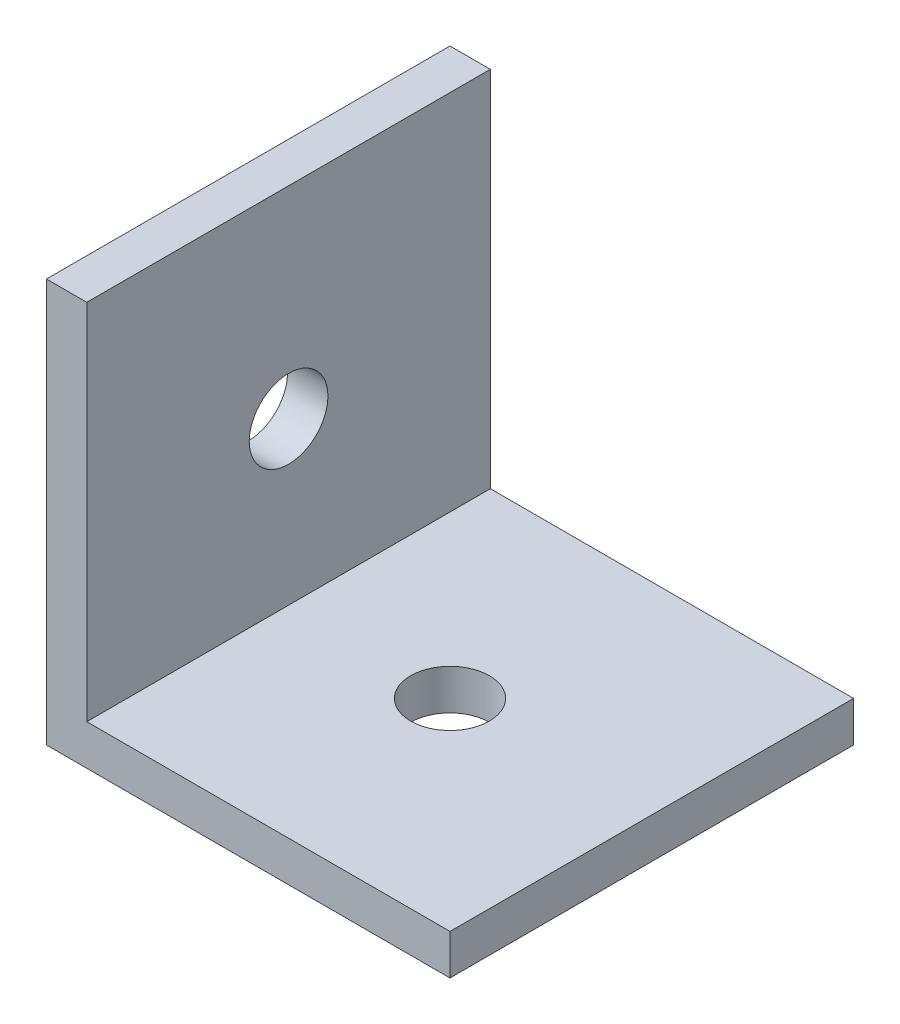
ISO-10303-21;
HEADER;
FILE_DESCRIPTION(('STEP AP214'),'2;1');
FILE_NAME('part.step','',(''),(''),'','','');
FILE_SCHEMA(('AUTOMOTIVE_DESIGN { 1 0 10303 214 1 1 1 1 }'));
ENDSEC;
DATA;
#1=APPLICATION_CONTEXT('core data for automotive mechanical design processes');
#2=APPLICATION_PROTOCOL_DEFINITION('international standard','automotive_design',2000,#1);
#3=PRODUCT_CONTEXT('',#1,'mechanical');
#4=PRODUCT('Part','Part','',(#3));
#5=PRODUCT_RELATED_PRODUCT_CATEGORY('part','',(#4));
#6=PRODUCT_DEFINITION_FORMATION('','',#4);
#7=PRODUCT_DEFINITION_CONTEXT('part definition',#1,'design');
#8=PRODUCT_DEFINITION('design','',#6,#7);
#9=PRODUCT_DEFINITION_SHAPE('','',#8);
#10=(LENGTH_UNIT() NAMED_UNIT(*) SI_UNIT(.MILLI.,.METRE.));
#11=(NAMED_UNIT(*) PLANE_ANGLE_UNIT() SI_UNIT($,.RADIAN.));
#12=(NAMED_UNIT(*) SI_UNIT($,.STERADIAN.) SOLID_ANGLE_UNIT());
#13=UNCERTAINTY_MEASURE_WITH_UNIT(LENGTH_MEASURE(1.E-05),#10,'distance_accuracy_value','');
#14=(GEOMETRIC_REPRESENTATION_CONTEXT(3) GLOBAL_UNCERTAINTY_ASSIGNED_CONTEXT((#13)) GLOBAL_UNIT_ASSIGNED_CONTEXT((#10,
#11,#12)) REPRESENTATION_CONTEXT('',''));
#15=CARTESIAN_POINT('',(0.,0.,0.));
#16=DIRECTION('',(0.,0.,1.));
#17=DIRECTION('',(1.,0.,0.));
#18=AXIS2_PLACEMENT_3D('',#15,#16,#17);
#19=CARTESIAN_POINT('',(0.,0.,25.4));
#20=DIRECTION('',(0.,1.,0.));
#21=DIRECTION('',(0.,0.,1.));
#22=AXIS2_PLACEMENT_3D('',#19,#20,#21);
#23=PLANE('',#22);
#24=CARTESIAN_POINT('',(12.7,0.,12.7));
#25=DIRECTION('',(0.,-1.,0.));
#26=DIRECTION('',(0.,0.,-1.));
#27=AXIS2_PLACEMENT_3D('',#24,#25,#26);
#28=CIRCLE('',#27,2.4765);
#29=CARTESIAN_POINT('',(12.7,0.,10.2235));
#30=VERTEX_POINT('',#29);
#31=EDGE_CURVE('E164',#30,#30,#28,.T.);
#32=ORIENTED_EDGE('',*,*,#31,.F.);
#33=EDGE_LOOP('',(#32));
#34=FACE_BOUND('',#33,.T.);
#35=DIRECTION('',(1.,0.,0.));
#36=VECTOR('',#35,1.);
#37=CARTESIAN_POINT('',(0.,0.,0.));
#38=LINE('',#37,#36);
#39=CARTESIAN_POINT('',(0.,0.,0.));
#40=VERTEX_POINT('',#39);
#41=CARTESIAN_POINT('',(25.4,0.,0.));
#42=VERTEX_POINT('',#41);
#43=EDGE_CURVE('E117',#40,#42,#38,.T.);
#44=ORIENTED_EDGE('',*,*,#43,.T.);
#45=DIRECTION('',(0.,0.,-1.));
#46=VECTOR('',#45,1.);
#47=CARTESIAN_POINT('',(25.4,0.,25.4));
#48=LINE('',#47,#46);
#49=CARTESIAN_POINT('',(25.4,0.,25.4));
#50=VERTEX_POINT('',#49);
#51=EDGE_CURVE('E11',#50,#42,#48,.T.);
#52=ORIENTED_EDGE('',*,*,#51,.F.);
#53=DIRECTION('',(1.,0.,0.));
#54=VECTOR('',#53,1.);
#55=CARTESIAN_POINT('',(0.,0.,25.4));
#56=LINE('',#55,#54);
#57=CARTESIAN_POINT('',(0.,0.,25.4));
#58=VERTEX_POINT('',#57);
#59=EDGE_CURVE('E82',#58,#50,#56,.T.);
#60=ORIENTED_EDGE('',*,*,#59,.F.);
#61=DIRECTION('',(0.,0.,-1.));
#62=VECTOR('',#61,1.);
#63=CARTESIAN_POINT('',(0.,0.,25.4));
#64=LINE('',#63,#62);
#65=EDGE_CURVE('E113',#58,#40,#64,.T.);
#66=ORIENTED_EDGE('',*,*,#65,.T.);
#67=EDGE_LOOP('',(#44,#52,#60,#66));
#68=FACE_BOUND('',#67,.T.);
#69=ADVANCED_FACE('F35',(#34,#68),#23,.F.);
#70=CARTESIAN_POINT('',(25.4,2.54,25.4));
#71=DIRECTION('',(1.,0.,0.));
#72=DIRECTION('',(0.,0.,-1.));
#73=AXIS2_PLACEMENT_3D('',#70,#71,#72);
#74=PLANE('',#73);
#75=DIRECTION('',(0.,-1.,0.));
#76=VECTOR('',#75,1.);
#77=CARTESIAN_POINT('',(25.4,2.54,0.));
#78=LINE('',#77,#76);
#79=CARTESIAN_POINT('',(25.4,2.54,0.));
#80=VERTEX_POINT('',#79);
#81=EDGE_CURVE('E120',#80,#42,#78,.T.);
#82=ORIENTED_EDGE('',*,*,#81,.F.);
#83=DIRECTION('',(0.,0.,-1.));
#84=VECTOR('',#83,1.);
#85=CARTESIAN_POINT('',(25.4,2.54,25.4));
#86=LINE('',#85,#84);
#87=CARTESIAN_POINT('',(25.4,2.54,25.4));
#88=VERTEX_POINT('',#87);
#89=EDGE_CURVE('E44',#88,#80,#86,.T.);
#90=ORIENTED_EDGE('',*,*,#89,.F.);
#91=DIRECTION('',(0.,-1.,0.));
#92=VECTOR('',#91,1.);
#93=CARTESIAN_POINT('',(25.4,2.54,25.4));
#94=LINE('',#93,#92);
#95=EDGE_CURVE('E175',#88,#50,#94,.T.);
#96=ORIENTED_EDGE('',*,*,#95,.T.);
#97=ORIENTED_EDGE('',*,*,#51,.T.);
#98=EDGE_LOOP('',(#82,#90,#96,#97));
#99=FACE_BOUND('',#98,.T.);
#100=ADVANCED_FACE('F140',(#99),#74,.T.);
#101=CARTESIAN_POINT('',(0.,2.54,25.4));
#102=DIRECTION('',(0.,1.,0.));
#103=DIRECTION('',(0.,0.,1.));
#104=AXIS2_PLACEMENT_3D('',#101,#102,#103);
#105=PLANE('',#104);
#106=CARTESIAN_POINT('',(12.7,2.54,12.7));
#107=DIRECTION('',(0.,1.,0.));
#108=DIRECTION('',(0.,0.,1.));
#109=AXIS2_PLACEMENT_3D('',#106,#107,#108);
#110=CIRCLE('',#109,2.4765);
#111=CARTESIAN_POINT('',(12.7,2.54,15.1765));
#112=VERTEX_POINT('',#111);
#113=EDGE_CURVE('E38',#112,#112,#110,.T.);
#114=ORIENTED_EDGE('',*,*,#113,.F.);
#115=EDGE_LOOP('',(#114));
#116=FACE_BOUND('',#115,.T.);
#117=DIRECTION('',(1.,0.,0.));
#118=VECTOR('',#117,1.);
#119=CARTESIAN_POINT('',(0.,2.54,0.));
#120=LINE('',#119,#118);
#121=CARTESIAN_POINT('',(2.54,2.54,0.));
#122=VERTEX_POINT('',#121);
#123=EDGE_CURVE('E124',#122,#80,#120,.T.);
#124=ORIENTED_EDGE('',*,*,#123,.F.);
#125=DIRECTION('',(0.,0.,-1.));
#126=VECTOR('',#125,1.);
#127=CARTESIAN_POINT('',(2.54,2.54,25.4));
#128=LINE('',#127,#126);
#129=CARTESIAN_POINT('',(2.54,2.54,25.4));
#130=VERTEX_POINT('',#129);
#131=EDGE_CURVE('E103',#130,#122,#128,.T.);
#132=ORIENTED_EDGE('',*,*,#131,.F.);
#133=DIRECTION('',(1.,0.,0.));
#134=VECTOR('',#133,1.);
#135=CARTESIAN_POINT('',(0.,2.54,25.4));
#136=LINE('',#135,#134);
#137=EDGE_CURVE('E109',#130,#88,#136,.T.);
#138=ORIENTED_EDGE('',*,*,#137,.T.);
#139=ORIENTED_EDGE('',*,*,#89,.T.);
#140=EDGE_LOOP('',(#124,#132,#138,#139));
#141=FACE_BOUND('',#140,.T.);
#142=ADVANCED_FACE('F137',(#116,#141),#105,.T.);
#143=CARTESIAN_POINT('',(2.54,0.,25.4));
#144=DIRECTION('',(1.,0.,0.));
#145=DIRECTION('',(0.,0.,-1.));
#146=AXIS2_PLACEMENT_3D('',#143,#144,#145);
#147=PLANE('',#146);
#148=CARTESIAN_POINT('',(2.54,12.7,12.7));
#149=DIRECTION('',(1.,0.,0.));
#150=DIRECTION('',(0.,0.,-1.));
#151=AXIS2_PLACEMENT_3D('',#148,#149,#150);
#152=CIRCLE('',#151,2.4765);
#153=CARTESIAN_POINT('',(2.54,12.7,10.2235));
#154=VERTEX_POINT('',#153);
#155=EDGE_CURVE('E121',#154,#154,#152,.T.);
#156=ORIENTED_EDGE('',*,*,#155,.F.);
#157=EDGE_LOOP('',(#156));
#158=FACE_BOUND('',#157,.T.);
#159=DIRECTION('',(0.,1.,0.));
#160=VECTOR('',#159,1.);
#161=CARTESIAN_POINT('',(2.54,0.,0.));
#162=LINE('',#161,#160);
#163=CARTESIAN_POINT('',(2.54,25.4,0.));
#164=VERTEX_POINT('',#163);
#165=EDGE_CURVE('E98',#164,#122,#162,.F.);
#166=ORIENTED_EDGE('',*,*,#165,.F.);
#167=DIRECTION('',(0.,0.,-1.));
#168=VECTOR('',#167,1.);
#169=CARTESIAN_POINT('',(2.54,25.4,25.4));
#170=LINE('',#169,#168);
#171=CARTESIAN_POINT('',(2.54,25.4,25.4));
#172=VERTEX_POINT('',#171);
#173=EDGE_CURVE('E93',#172,#164,#170,.T.);
#174=ORIENTED_EDGE('',*,*,#173,.F.);
#175=DIRECTION('',(0.,1.,0.));
#176=VECTOR('',#175,1.);
#177=CARTESIAN_POINT('',(2.54,0.,25.4));
#178=LINE('',#177,#176);
#179=EDGE_CURVE('E96',#172,#130,#178,.F.);
#180=ORIENTED_EDGE('',*,*,#179,.T.);
#181=ORIENTED_EDGE('',*,*,#131,.T.);
#182=EDGE_LOOP('',(#166,#174,#180,#181));
#183=FACE_BOUND('',#182,.T.);
#184=ADVANCED_FACE('F95',(#158,#183),#147,.T.);
#185=CARTESIAN_POINT('',(0.,25.4,25.4));
#186=DIRECTION('',(0.,1.,0.));
#187=DIRECTION('',(0.,0.,1.));
#188=AXIS2_PLACEMENT_3D('',#185,#186,#187);
#189=PLANE('',#188);
#190=DIRECTION('',(1.,0.,0.));
#191=VECTOR('',#190,1.);
#192=CARTESIAN_POINT('',(0.,25.4,0.));
#193=LINE('',#192,#191);
#194=CARTESIAN_POINT('',(0.,25.4,0.));
#195=VERTEX_POINT('',#194);
#196=EDGE_CURVE('E128',#195,#164,#193,.T.);
#197=ORIENTED_EDGE('',*,*,#196,.F.);
#198=DIRECTION('',(0.,0.,-1.));
#199=VECTOR('',#198,1.);
#200=CARTESIAN_POINT('',(0.,25.4,25.4));
#201=LINE('',#200,#199);
#202=CARTESIAN_POINT('',(0.,25.4,25.4));
#203=VERTEX_POINT('',#202);
#204=EDGE_CURVE('E73',#203,#195,#201,.T.);
#205=ORIENTED_EDGE('',*,*,#204,.F.);
#206=DIRECTION('',(1.,0.,0.));
#207=VECTOR('',#206,1.);
#208=CARTESIAN_POINT('',(0.,25.4,25.4));
#209=LINE('',#208,#207);
#210=EDGE_CURVE('E107',#203,#172,#209,.T.);
#211=ORIENTED_EDGE('',*,*,#210,.T.);
#212=ORIENTED_EDGE('',*,*,#173,.T.);
#213=EDGE_LOOP('',(#197,#205,#211,#212));
#214=FACE_BOUND('',#213,.T.);
#215=ADVANCED_FACE('F111',(#214),#189,.T.);
#216=CARTESIAN_POINT('',(0.,0.,25.4));
#217=DIRECTION('',(1.,0.,0.));
#218=DIRECTION('',(0.,0.,-1.));
#219=AXIS2_PLACEMENT_3D('',#216,#217,#218);
#220=PLANE('',#219);
#221=CARTESIAN_POINT('',(0.,12.7,12.7));
#222=DIRECTION('',(-1.,0.,0.));
#223=DIRECTION('',(0.,0.,1.));
#224=AXIS2_PLACEMENT_3D('',#221,#222,#223);
#225=CIRCLE('',#224,2.4765);
#226=CARTESIAN_POINT('',(0.,12.7,15.1765));
#227=VERTEX_POINT('',#226);
#228=EDGE_CURVE('E168',#227,#227,#225,.T.);
#229=ORIENTED_EDGE('',*,*,#228,.F.);
#230=EDGE_LOOP('',(#229));
#231=FACE_BOUND('',#230,.T.);
#232=DIRECTION('',(0.,-1.,0.));
#233=VECTOR('',#232,1.);
#234=CARTESIAN_POINT('',(0.,0.,0.));
#235=LINE('',#234,#233);
#236=EDGE_CURVE('E76',#195,#40,#235,.T.);
#237=ORIENTED_EDGE('',*,*,#236,.T.);
#238=ORIENTED_EDGE('',*,*,#65,.F.);
#239=DIRECTION('',(0.,-1.,0.));
#240=VECTOR('',#239,1.);
#241=CARTESIAN_POINT('',(0.,0.,25.4));
#242=LINE('',#241,#240);
#243=EDGE_CURVE('E52',#203,#58,#242,.T.);
#244=ORIENTED_EDGE('',*,*,#243,.F.);
#245=ORIENTED_EDGE('',*,*,#204,.T.);
#246=EDGE_LOOP('',(#237,#238,#244,#245));
#247=FACE_BOUND('',#246,.T.);
#248=ADVANCED_FACE('F145',(#231,#247),#220,.F.);
#249=CARTESIAN_POINT('',(0.,0.,25.4));
#250=DIRECTION('',(0.,0.,-1.));
#251=DIRECTION('',(-1.,0.,0.));
#252=AXIS2_PLACEMENT_3D('',#249,#250,#251);
#253=PLANE('',#252);
#254=ORIENTED_EDGE('',*,*,#59,.T.);
#255=ORIENTED_EDGE('',*,*,#95,.F.);
#256=ORIENTED_EDGE('',*,*,#137,.F.);
#257=ORIENTED_EDGE('',*,*,#179,.F.);
#258=ORIENTED_EDGE('',*,*,#210,.F.);
#259=ORIENTED_EDGE('',*,*,#243,.T.);
#260=EDGE_LOOP('',(#254,#255,#256,#257,#258,#259));
#261=FACE_BOUND('',#260,.T.);
#262=ADVANCED_FACE('F106',(#261),#253,.F.);
#263=CARTESIAN_POINT('',(0.,0.,0.));
#264=DIRECTION('',(0.,0.,-1.));
#265=DIRECTION('',(-1.,0.,0.));
#266=AXIS2_PLACEMENT_3D('',#263,#264,#265);
#267=PLANE('',#266);
#268=ORIENTED_EDGE('',*,*,#43,.F.);
#269=ORIENTED_EDGE('',*,*,#236,.F.);
#270=ORIENTED_EDGE('',*,*,#196,.T.);
#271=ORIENTED_EDGE('',*,*,#165,.T.);
#272=ORIENTED_EDGE('',*,*,#123,.T.);
#273=ORIENTED_EDGE('',*,*,#81,.T.);
#274=EDGE_LOOP('',(#268,#269,#270,#271,#272,#273));
#275=FACE_BOUND('',#274,.T.);
#276=ADVANCED_FACE('F143',(#275),#267,.T.);
#277=CARTESIAN_POINT('',(25.4,12.7,12.7));
#278=DIRECTION('',(-1.,0.,0.));
#279=DIRECTION('',(0.,0.,1.));
#280=AXIS2_PLACEMENT_3D('',#277,#278,#279);
#281=CYLINDRICAL_SURFACE('',#280,2.4765);
#282=ORIENTED_EDGE('',*,*,#155,.T.);
#283=EDGE_LOOP('',(#282));
#284=FACE_BOUND('',#283,.T.);
#285=ORIENTED_EDGE('',*,*,#228,.T.);
#286=EDGE_LOOP('',(#285));
#287=FACE_BOUND('',#286,.T.);
#288=ADVANCED_FACE('F178',(#284,#287),#281,.F.);
#289=CARTESIAN_POINT('',(12.7,25.4,12.7));
#290=DIRECTION('',(0.,-1.,0.));
#291=DIRECTION('',(0.,0.,-1.));
#292=AXIS2_PLACEMENT_3D('',#289,#290,#291);
#293=CYLINDRICAL_SURFACE('',#292,2.4765);
#294=ORIENTED_EDGE('',*,*,#113,.T.);
#295=EDGE_LOOP('',(#294));
#296=FACE_BOUND('',#295,.T.);
#297=ORIENTED_EDGE('',*,*,#31,.T.);
#298=EDGE_LOOP('',(#297));
#299=FACE_BOUND('',#298,.T.);
#300=ADVANCED_FACE('F192',(#296,#299),#293,.F.);
#301=CLOSED_SHELL('',(#69,#100,#142,#184,#215,#248,#262,#276,#288,#300));
#302=MANIFOLD_SOLID_BREP('B2',#301);
#303=ADVANCED_BREP_SHAPE_REPRESENTATION('',(#18,#302),#14);
#304=SHAPE_DEFINITION_REPRESENTATION(#9,#303);
ENDSEC;
END-ISO-10303-21;
